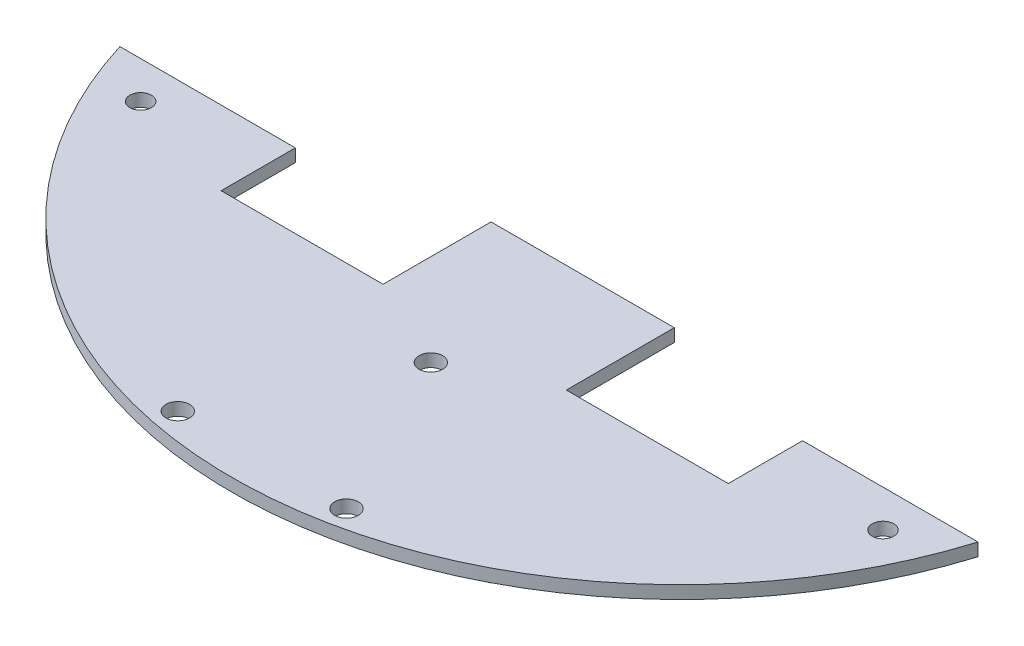
ISO-10303-21;
HEADER;
FILE_DESCRIPTION(('STEP AP214'),'2;1');
FILE_NAME('part.step','',(''),(''),'','','');
FILE_SCHEMA(('AUTOMOTIVE_DESIGN { 1 0 10303 214 1 1 1 1 }'));
ENDSEC;
DATA;
#1=APPLICATION_CONTEXT('core data for automotive mechanical design processes');
#2=APPLICATION_PROTOCOL_DEFINITION('international standard','automotive_design',2000,#1);
#3=PRODUCT_CONTEXT('',#1,'mechanical');
#4=PRODUCT('Part','Part','',(#3));
#5=PRODUCT_RELATED_PRODUCT_CATEGORY('part','',(#4));
#6=PRODUCT_DEFINITION_FORMATION('','',#4);
#7=PRODUCT_DEFINITION_CONTEXT('part definition',#1,'design');
#8=PRODUCT_DEFINITION('design','',#6,#7);
#9=PRODUCT_DEFINITION_SHAPE('','',#8);
#10=(LENGTH_UNIT() NAMED_UNIT(*) SI_UNIT(.MILLI.,.METRE.));
#11=(NAMED_UNIT(*) PLANE_ANGLE_UNIT() SI_UNIT($,.RADIAN.));
#12=(NAMED_UNIT(*) SI_UNIT($,.STERADIAN.) SOLID_ANGLE_UNIT());
#13=UNCERTAINTY_MEASURE_WITH_UNIT(LENGTH_MEASURE(1.E-05),#10,'distance_accuracy_value','');
#14=(GEOMETRIC_REPRESENTATION_CONTEXT(3) GLOBAL_UNCERTAINTY_ASSIGNED_CONTEXT((#13)) GLOBAL_UNIT_ASSIGNED_CONTEXT((#10,
#11,#12)) REPRESENTATION_CONTEXT('',''));
#15=CARTESIAN_POINT('',(0.,0.,0.));
#16=DIRECTION('',(0.,0.,1.));
#17=DIRECTION('',(1.,0.,0.));
#18=AXIS2_PLACEMENT_3D('',#15,#16,#17);
#19=CARTESIAN_POINT('',(-13.5767253010093,1.9,56.5743022047236));
#20=DIRECTION('',(-1.,0.,0.));
#21=DIRECTION('',(0.,0.,1.));
#22=AXIS2_PLACEMENT_3D('',#19,#20,#21);
#23=PLANE('',#22);
#24=DIRECTION('',(0.,0.,-1.));
#25=VECTOR('',#24,1.);
#26=CARTESIAN_POINT('',(-13.5767253010093,0.,56.5743022047236));
#27=LINE('',#26,#25);
#28=CARTESIAN_POINT('',(-13.5767253010093,0.,56.5743022047236));
#29=VERTEX_POINT('',#28);
#30=CARTESIAN_POINT('',(-13.5767253010093,0.,40.5743022047236));
#31=VERTEX_POINT('',#30);
#32=EDGE_CURVE('E142',#29,#31,#27,.T.);
#33=ORIENTED_EDGE('',*,*,#32,.F.);
#34=DIRECTION('',(0.,-1.,0.));
#35=VECTOR('',#34,1.);
#36=CARTESIAN_POINT('',(-13.5767253010093,1.9,56.5743022047236));
#37=LINE('',#36,#35);
#38=CARTESIAN_POINT('',(-13.5767253010093,1.9,56.5743022047236));
#39=VERTEX_POINT('',#38);
#40=EDGE_CURVE('E11',#39,#29,#37,.T.);
#41=ORIENTED_EDGE('',*,*,#40,.F.);
#42=DIRECTION('',(0.,0.,-1.));
#43=VECTOR('',#42,1.);
#44=CARTESIAN_POINT('',(-13.5767253010093,1.9,56.5743022047236));
#45=LINE('',#44,#43);
#46=CARTESIAN_POINT('',(-13.5767253010093,1.9,40.5743022047236));
#47=VERTEX_POINT('',#46);
#48=EDGE_CURVE('E169',#39,#47,#45,.T.);
#49=ORIENTED_EDGE('',*,*,#48,.T.);
#50=DIRECTION('',(0.,-1.,0.));
#51=VECTOR('',#50,1.);
#52=CARTESIAN_POINT('',(-13.5767253010093,1.9,40.5743022047236));
#53=LINE('',#52,#51);
#54=EDGE_CURVE('E94',#47,#31,#53,.T.);
#55=ORIENTED_EDGE('',*,*,#54,.T.);
#56=EDGE_LOOP('',(#33,#41,#49,#55));
#57=FACE_BOUND('',#56,.T.);
#58=ADVANCED_FACE('F32',(#57),#23,.T.);
#59=CARTESIAN_POINT('',(-37.5767253010093,1.9,56.5743022047236));
#60=DIRECTION('',(0.,0.,-1.));
#61=DIRECTION('',(-1.,0.,0.));
#62=AXIS2_PLACEMENT_3D('',#59,#60,#61);
#63=PLANE('',#62);
#64=DIRECTION('',(1.,0.,0.));
#65=VECTOR('',#64,1.);
#66=CARTESIAN_POINT('',(-37.5767253010093,0.,56.5743022047236));
#67=LINE('',#66,#65);
#68=CARTESIAN_POINT('',(-37.5767253010093,0.,56.5743022047236));
#69=VERTEX_POINT('',#68);
#70=EDGE_CURVE('E167',#69,#29,#67,.T.);
#71=ORIENTED_EDGE('',*,*,#70,.F.);
#72=DIRECTION('',(0.,-1.,0.));
#73=VECTOR('',#72,1.);
#74=CARTESIAN_POINT('',(-37.5767253010093,1.9,56.5743022047236));
#75=LINE('',#74,#73);
#76=CARTESIAN_POINT('',(-37.5767253010093,1.9,56.5743022047236));
#77=VERTEX_POINT('',#76);
#78=EDGE_CURVE('E41',#77,#69,#75,.T.);
#79=ORIENTED_EDGE('',*,*,#78,.F.);
#80=DIRECTION('',(1.,0.,0.));
#81=VECTOR('',#80,1.);
#82=CARTESIAN_POINT('',(-37.5767253010093,1.9,56.5743022047236));
#83=LINE('',#82,#81);
#84=EDGE_CURVE('E132',#77,#39,#83,.T.);
#85=ORIENTED_EDGE('',*,*,#84,.T.);
#86=ORIENTED_EDGE('',*,*,#40,.T.);
#87=EDGE_LOOP('',(#71,#79,#85,#86));
#88=FACE_BOUND('',#87,.T.);
#89=ADVANCED_FACE('F234',(#88),#63,.T.);
#90=CARTESIAN_POINT('',(-37.5767253010093,1.9,45.5743022047236));
#91=DIRECTION('',(1.,0.,0.));
#92=DIRECTION('',(0.,0.,-1.));
#93=AXIS2_PLACEMENT_3D('',#90,#91,#92);
#94=PLANE('',#93);
#95=DIRECTION('',(0.,0.,1.));
#96=VECTOR('',#95,1.);
#97=CARTESIAN_POINT('',(-37.5767253010093,0.,45.5743022047236));
#98=LINE('',#97,#96);
#99=CARTESIAN_POINT('',(-37.5767253010093,0.,45.5743022047236));
#100=VERTEX_POINT('',#99);
#101=EDGE_CURVE('E119',#100,#69,#98,.T.);
#102=ORIENTED_EDGE('',*,*,#101,.F.);
#103=DIRECTION('',(0.,-1.,0.));
#104=VECTOR('',#103,1.);
#105=CARTESIAN_POINT('',(-37.5767253010093,1.9,45.5743022047236));
#106=LINE('',#105,#104);
#107=CARTESIAN_POINT('',(-37.5767253010093,1.9,45.5743022047236));
#108=VERTEX_POINT('',#107);
#109=EDGE_CURVE('E114',#108,#100,#106,.T.);
#110=ORIENTED_EDGE('',*,*,#109,.F.);
#111=DIRECTION('',(0.,0.,1.));
#112=VECTOR('',#111,1.);
#113=CARTESIAN_POINT('',(-37.5767253010093,1.9,45.5743022047236));
#114=LINE('',#113,#112);
#115=EDGE_CURVE('E117',#108,#77,#114,.T.);
#116=ORIENTED_EDGE('',*,*,#115,.T.);
#117=ORIENTED_EDGE('',*,*,#78,.T.);
#118=EDGE_LOOP('',(#102,#110,#116,#117));
#119=FACE_BOUND('',#118,.T.);
#120=ADVANCED_FACE('F116',(#119),#94,.T.);
#121=CARTESIAN_POINT('',(-37.5767253010093,1.9,45.5743022047236));
#122=DIRECTION('',(0.,0.,-1.));
#123=DIRECTION('',(-1.,0.,0.));
#124=AXIS2_PLACEMENT_3D('',#121,#122,#123);
#125=PLANE('',#124);
#126=DIRECTION('',(1.,0.,0.));
#127=VECTOR('',#126,1.);
#128=CARTESIAN_POINT('',(-37.5767253010093,0.,45.5743022047236));
#129=LINE('',#128,#127);
#130=CARTESIAN_POINT('',(-63.5767253010093,0.,45.5743022047236));
#131=VERTEX_POINT('',#130);
#132=EDGE_CURVE('E164',#131,#100,#129,.T.);
#133=ORIENTED_EDGE('',*,*,#132,.F.);
#134=DIRECTION('',(0.,-1.,0.));
#135=VECTOR('',#134,1.);
#136=CARTESIAN_POINT('',(-63.5767253010093,1.9,45.5743022047236));
#137=LINE('',#136,#135);
#138=CARTESIAN_POINT('',(-63.5767253010093,1.9,45.5743022047236));
#139=VERTEX_POINT('',#138);
#140=EDGE_CURVE('E124',#139,#131,#137,.T.);
#141=ORIENTED_EDGE('',*,*,#140,.F.);
#142=DIRECTION('',(1.,0.,0.));
#143=VECTOR('',#142,1.);
#144=CARTESIAN_POINT('',(-37.5767253010093,1.9,45.5743022047236));
#145=LINE('',#144,#143);
#146=EDGE_CURVE('E130',#139,#108,#145,.T.);
#147=ORIENTED_EDGE('',*,*,#146,.T.);
#148=ORIENTED_EDGE('',*,*,#109,.T.);
#149=EDGE_LOOP('',(#133,#141,#147,#148));
#150=FACE_BOUND('',#149,.T.);
#151=ADVANCED_FACE('F134',(#150),#125,.T.);
#152=CARTESIAN_POINT('',(0.,1.9,26.0743022047236));
#153=DIRECTION('',(0.,-1.,0.));
#154=DIRECTION('',(0.,0.,-1.));
#155=AXIS2_PLACEMENT_3D('',#152,#153,#154);
#156=CYLINDRICAL_SURFACE('',#155,66.4999999999999);
#157=CARTESIAN_POINT('',(0.,0.,26.0743022047236));
#158=DIRECTION('',(0.,-1.,0.));
#159=DIRECTION('',(0.,0.,-1.));
#160=AXIS2_PLACEMENT_3D('',#157,#158,#159);
#161=CIRCLE('',#160,66.4999999999999);
#162=CARTESIAN_POINT('',(63.5767253010093,0.,45.5743022047236));
#163=VERTEX_POINT('',#162);
#164=EDGE_CURVE('E161',#163,#131,#161,.T.);
#165=ORIENTED_EDGE('',*,*,#164,.F.);
#166=DIRECTION('',(0.,-1.,0.));
#167=VECTOR('',#166,1.);
#168=CARTESIAN_POINT('',(63.5767253010093,1.9,45.5743022047236));
#169=LINE('',#168,#167);
#170=CARTESIAN_POINT('',(63.5767253010093,1.9,45.5743022047236));
#171=VERTEX_POINT('',#170);
#172=EDGE_CURVE('E173',#171,#163,#169,.T.);
#173=ORIENTED_EDGE('',*,*,#172,.F.);
#174=CARTESIAN_POINT('',(0.,1.9,26.0743022047236));
#175=DIRECTION('',(0.,-1.,0.));
#176=DIRECTION('',(0.,0.,-1.));
#177=AXIS2_PLACEMENT_3D('',#174,#175,#176);
#178=CIRCLE('',#177,66.4999999999999);
#179=EDGE_CURVE('E135',#171,#139,#178,.T.);
#180=ORIENTED_EDGE('',*,*,#179,.T.);
#181=ORIENTED_EDGE('',*,*,#140,.T.);
#182=EDGE_LOOP('',(#165,#173,#180,#181));
#183=FACE_BOUND('',#182,.T.);
#184=ADVANCED_FACE('F247',(#183),#156,.T.);
#185=CARTESIAN_POINT('',(37.5767253010093,1.9,45.5743022047236));
#186=DIRECTION('',(0.,0.,-1.));
#187=DIRECTION('',(-1.,0.,0.));
#188=AXIS2_PLACEMENT_3D('',#185,#186,#187);
#189=PLANE('',#188);
#190=DIRECTION('',(1.,0.,0.));
#191=VECTOR('',#190,1.);
#192=CARTESIAN_POINT('',(37.5767253010093,0.,45.5743022047236));
#193=LINE('',#192,#191);
#194=CARTESIAN_POINT('',(37.5767253010093,0.,45.5743022047236));
#195=VERTEX_POINT('',#194);
#196=EDGE_CURVE('E158',#195,#163,#193,.T.);
#197=ORIENTED_EDGE('',*,*,#196,.F.);
#198=DIRECTION('',(0.,-1.,0.));
#199=VECTOR('',#198,1.);
#200=CARTESIAN_POINT('',(37.5767253010093,1.9,45.5743022047236));
#201=LINE('',#200,#199);
#202=CARTESIAN_POINT('',(37.5767253010093,1.9,45.5743022047236));
#203=VERTEX_POINT('',#202);
#204=EDGE_CURVE('E175',#203,#195,#201,.T.);
#205=ORIENTED_EDGE('',*,*,#204,.F.);
#206=DIRECTION('',(1.,0.,0.));
#207=VECTOR('',#206,1.);
#208=CARTESIAN_POINT('',(37.5767253010093,1.9,45.5743022047236));
#209=LINE('',#208,#207);
#210=EDGE_CURVE('E137',#203,#171,#209,.T.);
#211=ORIENTED_EDGE('',*,*,#210,.T.);
#212=ORIENTED_EDGE('',*,*,#172,.T.);
#213=EDGE_LOOP('',(#197,#205,#211,#212));
#214=FACE_BOUND('',#213,.T.);
#215=ADVANCED_FACE('F217',(#214),#189,.T.);
#216=CARTESIAN_POINT('',(37.5767253010093,1.9,56.5743022047236));
#217=DIRECTION('',(-1.,0.,0.));
#218=DIRECTION('',(0.,0.,1.));
#219=AXIS2_PLACEMENT_3D('',#216,#217,#218);
#220=PLANE('',#219);
#221=DIRECTION('',(0.,0.,-1.));
#222=VECTOR('',#221,1.);
#223=CARTESIAN_POINT('',(37.5767253010093,0.,56.5743022047236));
#224=LINE('',#223,#222);
#225=CARTESIAN_POINT('',(37.5767253010093,0.,56.5743022047236));
#226=VERTEX_POINT('',#225);
#227=EDGE_CURVE('E155',#226,#195,#224,.T.);
#228=ORIENTED_EDGE('',*,*,#227,.F.);
#229=DIRECTION('',(0.,-1.,0.));
#230=VECTOR('',#229,1.);
#231=CARTESIAN_POINT('',(37.5767253010093,1.9,56.5743022047236));
#232=LINE('',#231,#230);
#233=CARTESIAN_POINT('',(37.5767253010093,1.9,56.5743022047236));
#234=VERTEX_POINT('',#233);
#235=EDGE_CURVE('E177',#234,#226,#232,.T.);
#236=ORIENTED_EDGE('',*,*,#235,.F.);
#237=DIRECTION('',(0.,0.,-1.));
#238=VECTOR('',#237,1.);
#239=CARTESIAN_POINT('',(37.5767253010093,1.9,56.5743022047236));
#240=LINE('',#239,#238);
#241=EDGE_CURVE('E211',#234,#203,#240,.T.);
#242=ORIENTED_EDGE('',*,*,#241,.T.);
#243=ORIENTED_EDGE('',*,*,#204,.T.);
#244=EDGE_LOOP('',(#228,#236,#242,#243));
#245=FACE_BOUND('',#244,.T.);
#246=ADVANCED_FACE('F223',(#245),#220,.T.);
#247=CARTESIAN_POINT('',(13.5767253010093,1.9,56.5743022047236));
#248=DIRECTION('',(0.,0.,-1.));
#249=DIRECTION('',(-1.,0.,0.));
#250=AXIS2_PLACEMENT_3D('',#247,#248,#249);
#251=PLANE('',#250);
#252=DIRECTION('',(1.,0.,0.));
#253=VECTOR('',#252,1.);
#254=CARTESIAN_POINT('',(13.5767253010093,0.,56.5743022047236));
#255=LINE('',#254,#253);
#256=CARTESIAN_POINT('',(13.5767253010093,0.,56.5743022047236));
#257=VERTEX_POINT('',#256);
#258=EDGE_CURVE('E152',#257,#226,#255,.T.);
#259=ORIENTED_EDGE('',*,*,#258,.F.);
#260=DIRECTION('',(0.,-1.,0.));
#261=VECTOR('',#260,1.);
#262=CARTESIAN_POINT('',(13.5767253010093,1.9,56.5743022047236));
#263=LINE('',#262,#261);
#264=CARTESIAN_POINT('',(13.5767253010093,1.9,56.5743022047236));
#265=VERTEX_POINT('',#264);
#266=EDGE_CURVE('E179',#265,#257,#263,.T.);
#267=ORIENTED_EDGE('',*,*,#266,.F.);
#268=DIRECTION('',(1.,0.,0.));
#269=VECTOR('',#268,1.);
#270=CARTESIAN_POINT('',(13.5767253010093,1.9,56.5743022047236));
#271=LINE('',#270,#269);
#272=EDGE_CURVE('E208',#265,#234,#271,.T.);
#273=ORIENTED_EDGE('',*,*,#272,.T.);
#274=ORIENTED_EDGE('',*,*,#235,.T.);
#275=EDGE_LOOP('',(#259,#267,#273,#274));
#276=FACE_BOUND('',#275,.T.);
#277=ADVANCED_FACE('F226',(#276),#251,.T.);
#278=CARTESIAN_POINT('',(13.5767253010093,1.9,40.5743022047236));
#279=DIRECTION('',(1.,0.,0.));
#280=DIRECTION('',(0.,0.,-1.));
#281=AXIS2_PLACEMENT_3D('',#278,#279,#280);
#282=PLANE('',#281);
#283=DIRECTION('',(0.,0.,1.));
#284=VECTOR('',#283,1.);
#285=CARTESIAN_POINT('',(13.5767253010093,0.,40.5743022047236));
#286=LINE('',#285,#284);
#287=CARTESIAN_POINT('',(13.5767253010093,0.,40.5743022047236));
#288=VERTEX_POINT('',#287);
#289=EDGE_CURVE('E149',#288,#257,#286,.T.);
#290=ORIENTED_EDGE('',*,*,#289,.F.);
#291=DIRECTION('',(0.,-1.,0.));
#292=VECTOR('',#291,1.);
#293=CARTESIAN_POINT('',(13.5767253010093,1.9,40.5743022047236));
#294=LINE('',#293,#292);
#295=CARTESIAN_POINT('',(13.5767253010093,1.9,40.5743022047236));
#296=VERTEX_POINT('',#295);
#297=EDGE_CURVE('E181',#296,#288,#294,.T.);
#298=ORIENTED_EDGE('',*,*,#297,.F.);
#299=DIRECTION('',(0.,0.,1.));
#300=VECTOR('',#299,1.);
#301=CARTESIAN_POINT('',(13.5767253010093,1.9,40.5743022047236));
#302=LINE('',#301,#300);
#303=EDGE_CURVE('E205',#296,#265,#302,.T.);
#304=ORIENTED_EDGE('',*,*,#303,.T.);
#305=ORIENTED_EDGE('',*,*,#266,.T.);
#306=EDGE_LOOP('',(#290,#298,#304,#305));
#307=FACE_BOUND('',#306,.T.);
#308=ADVANCED_FACE('F230',(#307),#282,.T.);
#309=CARTESIAN_POINT('',(-13.5767253010093,1.9,40.5743022047236));
#310=DIRECTION('',(0.,0.,-1.));
#311=DIRECTION('',(-1.,0.,0.));
#312=AXIS2_PLACEMENT_3D('',#309,#310,#311);
#313=PLANE('',#312);
#314=DIRECTION('',(1.,0.,0.));
#315=VECTOR('',#314,1.);
#316=CARTESIAN_POINT('',(-13.5767253010093,0.,40.5743022047236));
#317=LINE('',#316,#315);
#318=EDGE_CURVE('E145',#31,#288,#317,.T.);
#319=ORIENTED_EDGE('',*,*,#318,.F.);
#320=ORIENTED_EDGE('',*,*,#54,.F.);
#321=DIRECTION('',(1.,0.,0.));
#322=VECTOR('',#321,1.);
#323=CARTESIAN_POINT('',(-13.5767253010093,1.9,40.5743022047236));
#324=LINE('',#323,#322);
#325=EDGE_CURVE('E203',#47,#296,#324,.T.);
#326=ORIENTED_EDGE('',*,*,#325,.T.);
#327=ORIENTED_EDGE('',*,*,#297,.T.);
#328=EDGE_LOOP('',(#319,#320,#326,#327));
#329=FACE_BOUND('',#328,.T.);
#330=ADVANCED_FACE('F231',(#329),#313,.T.);
#331=CARTESIAN_POINT('',(0.,1.9,26.0743022047236));
#332=DIRECTION('',(0.,-1.,0.));
#333=DIRECTION('',(0.,0.,-1.));
#334=AXIS2_PLACEMENT_3D('',#331,#332,#333);
#335=PLANE('',#334);
#336=CARTESIAN_POINT('',(55.0000000000001,1.9,51.0743022047236));
#337=DIRECTION('',(0.,-1.,0.));
#338=DIRECTION('',(0.,0.,-1.));
#339=AXIS2_PLACEMENT_3D('',#336,#337,#338);
#340=CIRCLE('',#339,1.6);
#341=CARTESIAN_POINT('',(55.0000000000001,1.9,49.4743022047236));
#342=VERTEX_POINT('',#341);
#343=EDGE_CURVE('E295',#342,#342,#340,.T.);
#344=ORIENTED_EDGE('',*,*,#343,.T.);
#345=EDGE_LOOP('',(#344));
#346=FACE_BOUND('',#345,.T.);
#347=CARTESIAN_POINT('',(-54.9999999999999,1.9,51.0743022047236));
#348=DIRECTION('',(0.,-1.,0.));
#349=DIRECTION('',(0.,0.,-1.));
#350=AXIS2_PLACEMENT_3D('',#347,#348,#349);
#351=CIRCLE('',#350,1.6);
#352=CARTESIAN_POINT('',(-54.9999999999999,1.9,49.4743022047236));
#353=VERTEX_POINT('',#352);
#354=EDGE_CURVE('E299',#353,#353,#351,.T.);
#355=ORIENTED_EDGE('',*,*,#354,.T.);
#356=EDGE_LOOP('',(#355));
#357=FACE_BOUND('',#356,.T.);
#358=CARTESIAN_POINT('',(0.,1.9,63.0743022047236));
#359=DIRECTION('',(0.,1.,0.));
#360=DIRECTION('',(0.,0.,1.));
#361=AXIS2_PLACEMENT_3D('',#358,#359,#360);
#362=CIRCLE('',#361,1.75);
#363=CARTESIAN_POINT('',(0.,1.9,64.8243022047236));
#364=VERTEX_POINT('',#363);
#365=EDGE_CURVE('E198',#364,#364,#362,.T.);
#366=ORIENTED_EDGE('',*,*,#365,.F.);
#367=EDGE_LOOP('',(#366));
#368=FACE_BOUND('',#367,.T.);
#369=CARTESIAN_POINT('',(12.5000000000001,1.9,88.0743022047236));
#370=DIRECTION('',(0.,1.,0.));
#371=DIRECTION('',(0.,0.,1.));
#372=AXIS2_PLACEMENT_3D('',#369,#370,#371);
#373=CIRCLE('',#372,1.75);
#374=CARTESIAN_POINT('',(12.5000000000001,1.9,89.8243022047236));
#375=VERTEX_POINT('',#374);
#376=EDGE_CURVE('E188',#375,#375,#373,.T.);
#377=ORIENTED_EDGE('',*,*,#376,.F.);
#378=EDGE_LOOP('',(#377));
#379=FACE_BOUND('',#378,.T.);
#380=CARTESIAN_POINT('',(-12.5,1.9,88.0743022047236));
#381=DIRECTION('',(0.,1.,0.));
#382=DIRECTION('',(0.,0.,1.));
#383=AXIS2_PLACEMENT_3D('',#380,#381,#382);
#384=CIRCLE('',#383,1.75);
#385=CARTESIAN_POINT('',(-12.5,1.9,89.8243022047236));
#386=VERTEX_POINT('',#385);
#387=EDGE_CURVE('E185',#386,#386,#384,.T.);
#388=ORIENTED_EDGE('',*,*,#387,.F.);
#389=EDGE_LOOP('',(#388));
#390=FACE_BOUND('',#389,.T.);
#391=ORIENTED_EDGE('',*,*,#48,.F.);
#392=ORIENTED_EDGE('',*,*,#84,.F.);
#393=ORIENTED_EDGE('',*,*,#115,.F.);
#394=ORIENTED_EDGE('',*,*,#146,.F.);
#395=ORIENTED_EDGE('',*,*,#179,.F.);
#396=ORIENTED_EDGE('',*,*,#210,.F.);
#397=ORIENTED_EDGE('',*,*,#241,.F.);
#398=ORIENTED_EDGE('',*,*,#272,.F.);
#399=ORIENTED_EDGE('',*,*,#303,.F.);
#400=ORIENTED_EDGE('',*,*,#325,.F.);
#401=EDGE_LOOP('',(#391,#392,#393,#394,#395,#396,#397,#398,#399,#400));
#402=FACE_BOUND('',#401,.T.);
#403=ADVANCED_FACE('F128',(#346,#357,#368,#379,#390,#402),#335,.F.);
#404=CARTESIAN_POINT('',(0.,0.,26.0743022047236));
#405=DIRECTION('',(0.,-1.,0.));
#406=DIRECTION('',(0.,0.,-1.));
#407=AXIS2_PLACEMENT_3D('',#404,#405,#406);
#408=PLANE('',#407);
#409=CARTESIAN_POINT('',(55.0000000000001,0.,51.0743022047236));
#410=DIRECTION('',(0.,-1.,0.));
#411=DIRECTION('',(0.,0.,-1.));
#412=AXIS2_PLACEMENT_3D('',#409,#410,#411);
#413=CIRCLE('',#412,1.6);
#414=CARTESIAN_POINT('',(55.0000000000001,0.,49.4743022047236));
#415=VERTEX_POINT('',#414);
#416=EDGE_CURVE('E293',#415,#415,#413,.T.);
#417=ORIENTED_EDGE('',*,*,#416,.F.);
#418=EDGE_LOOP('',(#417));
#419=FACE_BOUND('',#418,.T.);
#420=CARTESIAN_POINT('',(-54.9999999999999,0.,51.0743022047236));
#421=DIRECTION('',(0.,-1.,0.));
#422=DIRECTION('',(0.,0.,-1.));
#423=AXIS2_PLACEMENT_3D('',#420,#421,#422);
#424=CIRCLE('',#423,1.6);
#425=CARTESIAN_POINT('',(-54.9999999999999,0.,49.4743022047236));
#426=VERTEX_POINT('',#425);
#427=EDGE_CURVE('E296',#426,#426,#424,.T.);
#428=ORIENTED_EDGE('',*,*,#427,.F.);
#429=EDGE_LOOP('',(#428));
#430=FACE_BOUND('',#429,.T.);
#431=CARTESIAN_POINT('',(0.,0.,63.0743022047236));
#432=DIRECTION('',(0.,-1.,0.));
#433=DIRECTION('',(0.,0.,-1.));
#434=AXIS2_PLACEMENT_3D('',#431,#432,#433);
#435=CIRCLE('',#434,1.75);
#436=CARTESIAN_POINT('',(0.,0.,61.3243022047236));
#437=VERTEX_POINT('',#436);
#438=EDGE_CURVE('E35',#437,#437,#435,.T.);
#439=ORIENTED_EDGE('',*,*,#438,.F.);
#440=EDGE_LOOP('',(#439));
#441=FACE_BOUND('',#440,.T.);
#442=CARTESIAN_POINT('',(12.5000000000001,0.,88.0743022047236));
#443=DIRECTION('',(0.,-1.,0.));
#444=DIRECTION('',(0.,0.,-1.));
#445=AXIS2_PLACEMENT_3D('',#442,#443,#444);
#446=CIRCLE('',#445,1.75);
#447=CARTESIAN_POINT('',(12.5000000000001,0.,86.3243022047236));
#448=VERTEX_POINT('',#447);
#449=EDGE_CURVE('E186',#448,#448,#446,.T.);
#450=ORIENTED_EDGE('',*,*,#449,.F.);
#451=EDGE_LOOP('',(#450));
#452=FACE_BOUND('',#451,.T.);
#453=CARTESIAN_POINT('',(-12.5,0.,88.0743022047236));
#454=DIRECTION('',(0.,-1.,0.));
#455=DIRECTION('',(0.,0.,-1.));
#456=AXIS2_PLACEMENT_3D('',#453,#454,#455);
#457=CIRCLE('',#456,1.75);
#458=CARTESIAN_POINT('',(-12.5,0.,86.3243022047236));
#459=VERTEX_POINT('',#458);
#460=EDGE_CURVE('E146',#459,#459,#457,.T.);
#461=ORIENTED_EDGE('',*,*,#460,.F.);
#462=EDGE_LOOP('',(#461));
#463=FACE_BOUND('',#462,.T.);
#464=ORIENTED_EDGE('',*,*,#32,.T.);
#465=ORIENTED_EDGE('',*,*,#318,.T.);
#466=ORIENTED_EDGE('',*,*,#289,.T.);
#467=ORIENTED_EDGE('',*,*,#258,.T.);
#468=ORIENTED_EDGE('',*,*,#227,.T.);
#469=ORIENTED_EDGE('',*,*,#196,.T.);
#470=ORIENTED_EDGE('',*,*,#164,.T.);
#471=ORIENTED_EDGE('',*,*,#132,.T.);
#472=ORIENTED_EDGE('',*,*,#101,.T.);
#473=ORIENTED_EDGE('',*,*,#70,.T.);
#474=EDGE_LOOP('',(#464,#465,#466,#467,#468,#469,#470,#471,#472,#473));
#475=FACE_BOUND('',#474,.T.);
#476=ADVANCED_FACE('F233',(#419,#430,#441,#452,#463,#475),#408,.T.);
#477=CARTESIAN_POINT('',(-12.5,-8.1,88.0743022047236));
#478=DIRECTION('',(0.,1.,0.));
#479=DIRECTION('',(0.,0.,1.));
#480=AXIS2_PLACEMENT_3D('',#477,#478,#479);
#481=CYLINDRICAL_SURFACE('',#480,1.75);
#482=ORIENTED_EDGE('',*,*,#460,.T.);
#483=EDGE_LOOP('',(#482));
#484=FACE_BOUND('',#483,.T.);
#485=ORIENTED_EDGE('',*,*,#387,.T.);
#486=EDGE_LOOP('',(#485));
#487=FACE_BOUND('',#486,.T.);
#488=ADVANCED_FACE('F266',(#484,#487),#481,.F.);
#489=CARTESIAN_POINT('',(12.5000000000001,-8.1,88.0743022047236));
#490=DIRECTION('',(0.,1.,0.));
#491=DIRECTION('',(0.,0.,1.));
#492=AXIS2_PLACEMENT_3D('',#489,#490,#491);
#493=CYLINDRICAL_SURFACE('',#492,1.75);
#494=ORIENTED_EDGE('',*,*,#449,.T.);
#495=EDGE_LOOP('',(#494));
#496=FACE_BOUND('',#495,.T.);
#497=ORIENTED_EDGE('',*,*,#376,.T.);
#498=EDGE_LOOP('',(#497));
#499=FACE_BOUND('',#498,.T.);
#500=ADVANCED_FACE('F273',(#496,#499),#493,.F.);
#501=CARTESIAN_POINT('',(0.,-8.1,63.0743022047236));
#502=DIRECTION('',(0.,1.,0.));
#503=DIRECTION('',(0.,0.,1.));
#504=AXIS2_PLACEMENT_3D('',#501,#502,#503);
#505=CYLINDRICAL_SURFACE('',#504,1.75);
#506=ORIENTED_EDGE('',*,*,#438,.T.);
#507=EDGE_LOOP('',(#506));
#508=FACE_BOUND('',#507,.T.);
#509=ORIENTED_EDGE('',*,*,#365,.T.);
#510=EDGE_LOOP('',(#509));
#511=FACE_BOUND('',#510,.T.);
#512=ADVANCED_FACE('F277',(#508,#511),#505,.F.);
#513=CARTESIAN_POINT('',(-54.9999999999999,4.,51.0743022047236));
#514=DIRECTION('',(0.,-1.,0.));
#515=DIRECTION('',(0.,0.,-1.));
#516=AXIS2_PLACEMENT_3D('',#513,#514,#515);
#517=CYLINDRICAL_SURFACE('',#516,1.6);
#518=ORIENTED_EDGE('',*,*,#427,.T.);
#519=EDGE_LOOP('',(#518));
#520=FACE_BOUND('',#519,.T.);
#521=ORIENTED_EDGE('',*,*,#354,.F.);
#522=EDGE_LOOP('',(#521));
#523=FACE_BOUND('',#522,.T.);
#524=ADVANCED_FACE('F280',(#520,#523),#517,.F.);
#525=CARTESIAN_POINT('',(55.0000000000001,4.,51.0743022047236));
#526=DIRECTION('',(0.,-1.,0.));
#527=DIRECTION('',(0.,0.,-1.));
#528=AXIS2_PLACEMENT_3D('',#525,#526,#527);
#529=CYLINDRICAL_SURFACE('',#528,1.6);
#530=ORIENTED_EDGE('',*,*,#416,.T.);
#531=EDGE_LOOP('',(#530));
#532=FACE_BOUND('',#531,.T.);
#533=ORIENTED_EDGE('',*,*,#343,.F.);
#534=EDGE_LOOP('',(#533));
#535=FACE_BOUND('',#534,.T.);
#536=ADVANCED_FACE('F284',(#532,#535),#529,.F.);
#537=CLOSED_SHELL('',(#58,#89,#120,#151,#184,#215,#246,#277,#308,#330,#403,#476,#488,#500,#512,
#524,#536));
#538=MANIFOLD_SOLID_BREP('B2',#537);
#539=ADVANCED_BREP_SHAPE_REPRESENTATION('',(#18,#538),#14);
#540=SHAPE_DEFINITION_REPRESENTATION(#9,#539);
ENDSEC;
END-ISO-10303-21;
